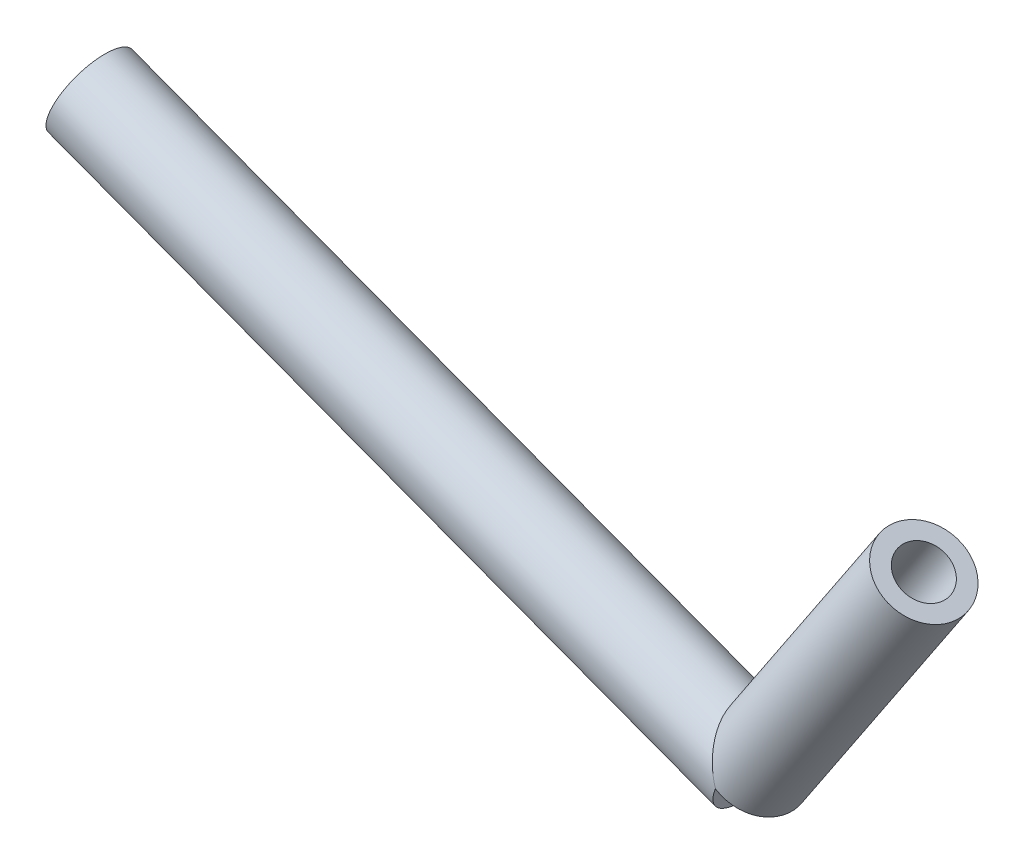
ISO-10303-21;
HEADER;
FILE_DESCRIPTION(('STEP AP214'),'2;1');
FILE_NAME('part.step','',(''),(''),'','','');
FILE_SCHEMA(('AUTOMOTIVE_DESIGN { 1 0 10303 214 1 1 1 1 }'));
ENDSEC;
DATA;
#1=APPLICATION_CONTEXT('core data for automotive mechanical design processes');
#2=APPLICATION_PROTOCOL_DEFINITION('international standard','automotive_design',2000,#1);
#3=PRODUCT_CONTEXT('',#1,'mechanical');
#4=PRODUCT('Part','Part','',(#3));
#5=PRODUCT_RELATED_PRODUCT_CATEGORY('part','',(#4));
#6=PRODUCT_DEFINITION_FORMATION('','',#4);
#7=PRODUCT_DEFINITION_CONTEXT('part definition',#1,'design');
#8=PRODUCT_DEFINITION('design','',#6,#7);
#9=PRODUCT_DEFINITION_SHAPE('','',#8);
#10=(LENGTH_UNIT() NAMED_UNIT(*) SI_UNIT(.MILLI.,.METRE.));
#11=(NAMED_UNIT(*) PLANE_ANGLE_UNIT() SI_UNIT($,.RADIAN.));
#12=(NAMED_UNIT(*) SI_UNIT($,.STERADIAN.) SOLID_ANGLE_UNIT());
#13=UNCERTAINTY_MEASURE_WITH_UNIT(LENGTH_MEASURE(1.E-05),#10,'distance_accuracy_value','');
#14=(GEOMETRIC_REPRESENTATION_CONTEXT(3) GLOBAL_UNCERTAINTY_ASSIGNED_CONTEXT((#13)) GLOBAL_UNIT_ASSIGNED_CONTEXT((#10,
#11,#12)) REPRESENTATION_CONTEXT('',''));
#15=CARTESIAN_POINT('',(0.,0.,0.));
#16=DIRECTION('',(0.,0.,1.));
#17=DIRECTION('',(1.,0.,0.));
#18=AXIS2_PLACEMENT_3D('',#15,#16,#17);
#19=CARTESIAN_POINT('',(100.,-1.38777878078145E-13,0.));
#20=DIRECTION('',(-0.554700196225229,-0.832050294337844,0.));
#21=DIRECTION('',(0.832050294337844,-0.554700196225229,0.));
#22=AXIS2_PLACEMENT_3D('',#19,#20,#21);
#23=CYLINDRICAL_SURFACE('',#22,15.);
#24=CARTESIAN_POINT('',(100.,-1.38777878078145E-13,0.));
#25=DIRECTION('',(0.554700196225229,0.832050294337844,0.));
#26=DIRECTION('',(-0.832050294337844,0.554700196225229,0.));
#27=AXIS2_PLACEMENT_3D('',#24,#25,#26);
#28=CIRCLE('',#27,15.);
#29=CARTESIAN_POINT('',(87.5192455849323,8.3205029433783,0.));
#30=VERTEX_POINT('',#29);
#31=EDGE_CURVE('E61',#30,#30,#28,.T.);
#32=ORIENTED_EDGE('',*,*,#31,.T.);
#33=EDGE_LOOP('',(#32));
#34=FACE_BOUND('',#33,.T.);
#35=CARTESIAN_POINT('',(0.,-150.,0.));
#36=DIRECTION('',(0.554700196225229,0.832050294337844,0.));
#37=DIRECTION('',(-0.832050294337844,0.554700196225229,0.));
#38=AXIS2_PLACEMENT_3D('',#35,#36,#37);
#39=CIRCLE('',#38,15.);
#40=CARTESIAN_POINT('',(-12.4807544150677,-141.679497056622,0.));
#41=VERTEX_POINT('',#40);
#42=EDGE_CURVE('E67',#41,#41,#39,.T.);
#43=ORIENTED_EDGE('',*,*,#42,.F.);
#44=EDGE_LOOP('',(#43));
#45=FACE_BOUND('',#44,.T.);
#46=ADVANCED_FACE('F54',(#34,#45),#23,.F.);
#47=CARTESIAN_POINT('',(100.,-1.38777878078145E-13,0.));
#48=DIRECTION('',(-0.554700196225229,-0.832050294337844,0.));
#49=DIRECTION('',(0.832050294337844,-0.554700196225229,0.));
#50=AXIS2_PLACEMENT_3D('',#47,#48,#49);
#51=CYLINDRICAL_SURFACE('',#50,25.);
#52=CARTESIAN_POINT('',(100.,-1.38777878078145E-13,0.));
#53=DIRECTION('',(0.554700196225229,0.832050294337844,0.));
#54=DIRECTION('',(-0.832050294337844,0.554700196225229,0.));
#55=AXIS2_PLACEMENT_3D('',#52,#53,#54);
#56=CIRCLE('',#55,25.);
#57=CARTESIAN_POINT('',(79.1987426415539,13.8675049056306,0.));
#58=VERTEX_POINT('',#57);
#59=EDGE_CURVE('E12',#58,#58,#56,.T.);
#60=ORIENTED_EDGE('',*,*,#59,.F.);
#61=EDGE_LOOP('',(#60));
#62=FACE_BOUND('',#61,.T.);
#63=CARTESIAN_POINT('',(0.,-150.,0.));
#64=DIRECTION('',(0.554700196225229,0.832050294337844,0.));
#65=DIRECTION('',(-0.832050294337844,0.554700196225229,0.));
#66=AXIS2_PLACEMENT_3D('',#63,#64,#65);
#67=CIRCLE('',#66,25.);
#68=CARTESIAN_POINT('',(-20.8012573584461,-136.132495094369,0.));
#69=VERTEX_POINT('',#68);
#70=EDGE_CURVE('E57',#69,#69,#67,.T.);
#71=ORIENTED_EDGE('',*,*,#70,.T.);
#72=EDGE_LOOP('',(#71));
#73=FACE_BOUND('',#72,.T.);
#74=ADVANCED_FACE('F74',(#62,#73),#51,.T.);
#75=CARTESIAN_POINT('',(100.,-1.38777878078145E-13,0.));
#76=DIRECTION('',(0.554700196225229,0.832050294337844,0.));
#77=DIRECTION('',(-0.832050294337844,0.554700196225229,0.));
#78=AXIS2_PLACEMENT_3D('',#75,#76,#77);
#79=PLANE('',#78);
#80=ORIENTED_EDGE('',*,*,#31,.F.);
#81=EDGE_LOOP('',(#80));
#82=FACE_BOUND('',#81,.T.);
#83=ORIENTED_EDGE('',*,*,#59,.T.);
#84=EDGE_LOOP('',(#83));
#85=FACE_BOUND('',#84,.T.);
#86=ADVANCED_FACE('F78',(#82,#85),#79,.T.);
#87=CARTESIAN_POINT('',(0.,-150.,0.));
#88=DIRECTION('',(0.554700196225229,0.832050294337844,0.));
#89=DIRECTION('',(-0.832050294337844,0.554700196225229,0.));
#90=AXIS2_PLACEMENT_3D('',#87,#88,#89);
#91=PLANE('',#90);
#92=ORIENTED_EDGE('',*,*,#42,.T.);
#93=EDGE_LOOP('',(#92));
#94=FACE_BOUND('',#93,.T.);
#95=ORIENTED_EDGE('',*,*,#70,.F.);
#96=EDGE_LOOP('',(#95));
#97=FACE_BOUND('',#96,.T.);
#98=ADVANCED_FACE('F76',(#94,#97),#91,.F.);
#99=CLOSED_SHELL('',(#46,#74,#86,#98));
#100=MANIFOLD_SOLID_BREP('B2',#99);
#101=CARTESIAN_POINT('',(-1.11022302462516E-13,-150.,0.));
#102=DIRECTION('',(-0.936329177569044,0.351123441588392,0.));
#103=DIRECTION('',(-0.351123441588392,-0.936329177569045,0.));
#104=AXIS2_PLACEMENT_3D('',#101,#102,#103);
#105=CYLINDRICAL_SURFACE('',#104,15.);
#106=CARTESIAN_POINT('',(-1.11022302462516E-13,-150.,0.));
#107=DIRECTION('',(0.936329177569045,-0.351123441588392,0.));
#108=DIRECTION('',(0.351123441588392,0.936329177569045,0.));
#109=AXIS2_PLACEMENT_3D('',#106,#107,#108);
#110=CIRCLE('',#109,15.);
#111=CARTESIAN_POINT('',(5.26685162382577,-135.955062336464,0.));
#112=VERTEX_POINT('',#111);
#113=EDGE_CURVE('E132',#112,#112,#110,.T.);
#114=ORIENTED_EDGE('',*,*,#113,.T.);
#115=EDGE_LOOP('',(#114));
#116=FACE_BOUND('',#115,.T.);
#117=CARTESIAN_POINT('',(-400.,0.,0.));
#118=DIRECTION('',(0.936329177569045,-0.351123441588392,0.));
#119=DIRECTION('',(0.351123441588392,0.936329177569045,0.));
#120=AXIS2_PLACEMENT_3D('',#117,#118,#119);
#121=CIRCLE('',#120,15.);
#122=CARTESIAN_POINT('',(-394.733148376174,14.0449376635356,0.));
#123=VERTEX_POINT('',#122);
#124=EDGE_CURVE('E139',#123,#123,#121,.T.);
#125=ORIENTED_EDGE('',*,*,#124,.F.);
#126=EDGE_LOOP('',(#125));
#127=FACE_BOUND('',#126,.T.);
#128=ADVANCED_FACE('F124',(#116,#127),#105,.F.);
#129=CARTESIAN_POINT('',(-1.11022302462516E-13,-150.,0.));
#130=DIRECTION('',(-0.936329177569044,0.351123441588392,0.));
#131=DIRECTION('',(-0.351123441588392,-0.936329177569045,0.));
#132=AXIS2_PLACEMENT_3D('',#129,#130,#131);
#133=CYLINDRICAL_SURFACE('',#132,25.);
#134=CARTESIAN_POINT('',(-1.11022302462516E-13,-150.,0.));
#135=DIRECTION('',(0.936329177569045,-0.351123441588392,0.));
#136=DIRECTION('',(0.351123441588392,0.936329177569045,0.));
#137=AXIS2_PLACEMENT_3D('',#134,#135,#136);
#138=CIRCLE('',#137,25.);
#139=CARTESIAN_POINT('',(8.77808603970969,-126.591770560774,0.));
#140=VERTEX_POINT('',#139);
#141=EDGE_CURVE('E53',#140,#140,#138,.T.);
#142=ORIENTED_EDGE('',*,*,#141,.F.);
#143=EDGE_LOOP('',(#142));
#144=FACE_BOUND('',#143,.T.);
#145=CARTESIAN_POINT('',(-400.,0.,0.));
#146=DIRECTION('',(0.936329177569045,-0.351123441588392,0.));
#147=DIRECTION('',(0.351123441588392,0.936329177569045,0.));
#148=AXIS2_PLACEMENT_3D('',#145,#146,#147);
#149=CIRCLE('',#148,25.);
#150=CARTESIAN_POINT('',(-391.22191396029,23.4082294392261,0.));
#151=VERTEX_POINT('',#150);
#152=EDGE_CURVE('E127',#151,#151,#149,.T.);
#153=ORIENTED_EDGE('',*,*,#152,.T.);
#154=EDGE_LOOP('',(#153));
#155=FACE_BOUND('',#154,.T.);
#156=ADVANCED_FACE('F148',(#144,#155),#133,.T.);
#157=CARTESIAN_POINT('',(-1.11022302462516E-13,-150.,0.));
#158=DIRECTION('',(0.936329177569045,-0.351123441588392,0.));
#159=DIRECTION('',(0.351123441588392,0.936329177569045,0.));
#160=AXIS2_PLACEMENT_3D('',#157,#158,#159);
#161=PLANE('',#160);
#162=ORIENTED_EDGE('',*,*,#113,.F.);
#163=EDGE_LOOP('',(#162));
#164=FACE_BOUND('',#163,.T.);
#165=ORIENTED_EDGE('',*,*,#141,.T.);
#166=EDGE_LOOP('',(#165));
#167=FACE_BOUND('',#166,.T.);
#168=ADVANCED_FACE('F152',(#164,#167),#161,.T.);
#169=CARTESIAN_POINT('',(-400.,0.,0.));
#170=DIRECTION('',(0.936329177569045,-0.351123441588392,0.));
#171=DIRECTION('',(0.351123441588392,0.936329177569045,0.));
#172=AXIS2_PLACEMENT_3D('',#169,#170,#171);
#173=PLANE('',#172);
#174=ORIENTED_EDGE('',*,*,#124,.T.);
#175=EDGE_LOOP('',(#174));
#176=FACE_BOUND('',#175,.T.);
#177=ORIENTED_EDGE('',*,*,#152,.F.);
#178=EDGE_LOOP('',(#177));
#179=FACE_BOUND('',#178,.T.);
#180=ADVANCED_FACE('F150',(#176,#179),#173,.F.);
#181=CLOSED_SHELL('',(#128,#156,#168,#180));
#182=MANIFOLD_SOLID_BREP('B7',#181);
#183=ADVANCED_BREP_SHAPE_REPRESENTATION('',(#18,#100,#182),#14);
#184=SHAPE_DEFINITION_REPRESENTATION(#9,#183);
ENDSEC;
END-ISO-10303-21;
